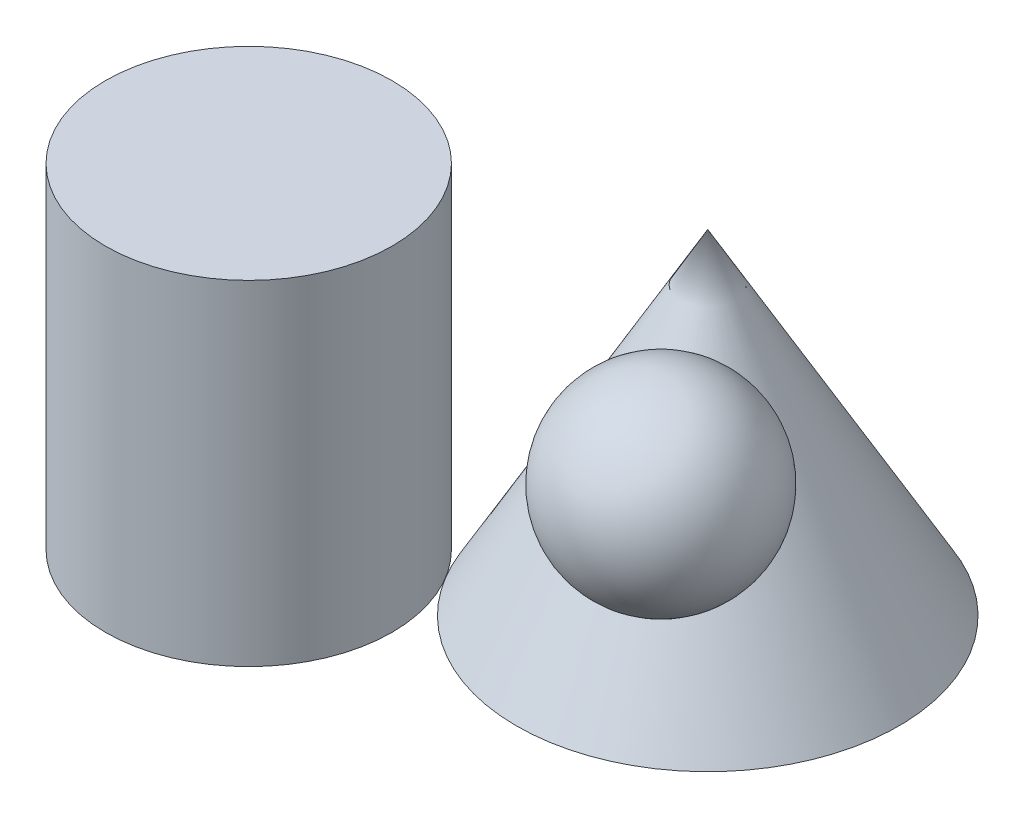
ISO-10303-21;
HEADER;
FILE_DESCRIPTION(('STEP AP214'),'2;1');
FILE_NAME('part.step','',(''),(''),'','','');
FILE_SCHEMA(('AUTOMOTIVE_DESIGN { 1 0 10303 214 1 1 1 1 }'));
ENDSEC;
DATA;
#1=APPLICATION_CONTEXT('core data for automotive mechanical design processes');
#2=APPLICATION_PROTOCOL_DEFINITION('international standard','automotive_design',2000,#1);
#3=PRODUCT_CONTEXT('',#1,'mechanical');
#4=PRODUCT('Part','Part','',(#3));
#5=PRODUCT_RELATED_PRODUCT_CATEGORY('part','',(#4));
#6=PRODUCT_DEFINITION_FORMATION('','',#4);
#7=PRODUCT_DEFINITION_CONTEXT('part definition',#1,'design');
#8=PRODUCT_DEFINITION('design','',#6,#7);
#9=PRODUCT_DEFINITION_SHAPE('','',#8);
#10=(LENGTH_UNIT() NAMED_UNIT(*) SI_UNIT(.MILLI.,.METRE.));
#11=(NAMED_UNIT(*) PLANE_ANGLE_UNIT() SI_UNIT($,.RADIAN.));
#12=(NAMED_UNIT(*) SI_UNIT($,.STERADIAN.) SOLID_ANGLE_UNIT());
#13=UNCERTAINTY_MEASURE_WITH_UNIT(LENGTH_MEASURE(1.E-05),#10,'distance_accuracy_value','');
#14=(GEOMETRIC_REPRESENTATION_CONTEXT(3) GLOBAL_UNCERTAINTY_ASSIGNED_CONTEXT((#13)) GLOBAL_UNIT_ASSIGNED_CONTEXT((#10,
#11,#12)) REPRESENTATION_CONTEXT('',''));
#15=CARTESIAN_POINT('',(0.,0.,0.));
#16=DIRECTION('',(0.,0.,1.));
#17=DIRECTION('',(1.,0.,0.));
#18=AXIS2_PLACEMENT_3D('',#15,#16,#17);
#19=CARTESIAN_POINT('',(19.6322928261529,48.3742051068268,29.4484392392294));
#20=DIRECTION('',(0.,1.,0.));
#21=DIRECTION('',(-0.554700196225229,0.,-0.832050294337843));
#22=AXIS2_PLACEMENT_3D('',#19,#20,#21);
#23=SPHERICAL_SURFACE('',#22,20.);
#24=CARTESIAN_POINT('',(19.6322928261529,68.3742051068268,29.4484392392294));
#25=VERTEX_POINT('',#24);
#26=VERTEX_LOOP('',#25);
#27=FACE_BOUND('',#26,.T.);
#28=ADVANCED_FACE('F40',(#27),#23,.T.);
#29=CLOSED_SHELL('',(#28));
#30=MANIFOLD_SOLID_BREP('B2',#29);
#31=CARTESIAN_POINT('',(-60.,70.,36.0555127546399));
#32=DIRECTION('',(0.,-1.,0.));
#33=DIRECTION('',(0.,0.,-1.));
#34=AXIS2_PLACEMENT_3D('',#31,#32,#33);
#35=CYLINDRICAL_SURFACE('',#34,30.);
#36=CARTESIAN_POINT('',(-60.,70.,36.0555127546399));
#37=DIRECTION('',(0.,1.,0.));
#38=DIRECTION('',(0.,0.,1.));
#39=AXIS2_PLACEMENT_3D('',#36,#37,#38);
#40=CIRCLE('',#39,30.);
#41=CARTESIAN_POINT('',(-60.,70.,66.0555127546399));
#42=VERTEX_POINT('',#41);
#43=EDGE_CURVE('E39',#42,#42,#40,.T.);
#44=ORIENTED_EDGE('',*,*,#43,.F.);
#45=EDGE_LOOP('',(#44));
#46=FACE_BOUND('',#45,.T.);
#47=CARTESIAN_POINT('',(-60.,0.,36.0555127546399));
#48=DIRECTION('',(0.,1.,0.));
#49=DIRECTION('',(0.,0.,1.));
#50=AXIS2_PLACEMENT_3D('',#47,#48,#49);
#51=CIRCLE('',#50,30.);
#52=CARTESIAN_POINT('',(-60.,0.,66.0555127546399));
#53=VERTEX_POINT('',#52);
#54=EDGE_CURVE('E65',#53,#53,#51,.T.);
#55=ORIENTED_EDGE('',*,*,#54,.T.);
#56=EDGE_LOOP('',(#55));
#57=FACE_BOUND('',#56,.T.);
#58=ADVANCED_FACE('F62',(#46,#57),#35,.T.);
#59=CARTESIAN_POINT('',(-60.,70.,36.0555127546399));
#60=DIRECTION('',(0.,1.,0.));
#61=DIRECTION('',(0.,0.,1.));
#62=AXIS2_PLACEMENT_3D('',#59,#60,#61);
#63=PLANE('',#62);
#64=ORIENTED_EDGE('',*,*,#43,.T.);
#65=EDGE_LOOP('',(#64));
#66=FACE_BOUND('',#65,.T.);
#67=ADVANCED_FACE('F77',(#66),#63,.T.);
#68=CARTESIAN_POINT('',(-60.,0.,36.0555127546399));
#69=DIRECTION('',(0.,1.,0.));
#70=DIRECTION('',(0.,0.,1.));
#71=AXIS2_PLACEMENT_3D('',#68,#69,#70);
#72=PLANE('',#71);
#73=ORIENTED_EDGE('',*,*,#54,.F.);
#74=EDGE_LOOP('',(#73));
#75=FACE_BOUND('',#74,.T.);
#76=ADVANCED_FACE('F75',(#75),#72,.F.);
#77=CLOSED_SHELL('',(#58,#67,#76));
#78=MANIFOLD_SOLID_BREP('B6',#77);
#79=CARTESIAN_POINT('',(20.,0.,0.));
#80=DIRECTION('',(0.,1.,0.));
#81=DIRECTION('',(0.,0.,1.));
#82=AXIS2_PLACEMENT_3D('',#79,#80,#81);
#83=PLANE('',#82);
#84=CARTESIAN_POINT('',(0.,0.,0.));
#85=DIRECTION('',(0.,-1.,0.));
#86=DIRECTION('',(0.,0.,-1.));
#87=AXIS2_PLACEMENT_3D('',#84,#85,#86);
#88=CIRCLE('',#87,40.);
#89=CARTESIAN_POINT('',(-34.2857142857143,0.,20.6031501455085));
#90=VERTEX_POINT('',#89);
#91=EDGE_CURVE('E60',#90,#90,#88,.T.);
#92=ORIENTED_EDGE('',*,*,#91,.T.);
#93=EDGE_LOOP('',(#92));
#94=FACE_BOUND('',#93,.T.);
#95=ADVANCED_FACE('F103',(#94),#83,.F.);
#96=CARTESIAN_POINT('',(0.,70.,0.));
#97=DIRECTION('',(0.,-1.,0.));
#98=DIRECTION('',(0.,0.,-1.));
#99=AXIS2_PLACEMENT_3D('',#96,#97,#98);
#100=CONICAL_SURFACE('',#99,0.,0.519146114246523);
#101=CARTESIAN_POINT('',(10.,38.4514263396901,15.));
#102=VERTEX_POINT('',#101);
#103=VERTEX_LOOP('',#102);
#104=FACE_BOUND('',#103,.T.);
#105=ORIENTED_EDGE('',*,*,#91,.F.);
#106=EDGE_LOOP('',(#105));
#107=FACE_BOUND('',#106,.T.);
#108=CARTESIAN_POINT('',(0.,70.,0.));
#109=VERTEX_POINT('',#108);
#110=VERTEX_LOOP('',#109);
#111=FACE_BOUND('',#110,.T.);
#112=ADVANCED_FACE('F118',(#104,#107,#111),#100,.T.);
#113=CLOSED_SHELL('',(#95,#112));
#114=MANIFOLD_SOLID_BREP('B34',#113);
#115=ADVANCED_BREP_SHAPE_REPRESENTATION('',(#18,#30,#78,#114),#14);
#116=SHAPE_DEFINITION_REPRESENTATION(#9,#115);
ENDSEC;
END-ISO-10303-21;
